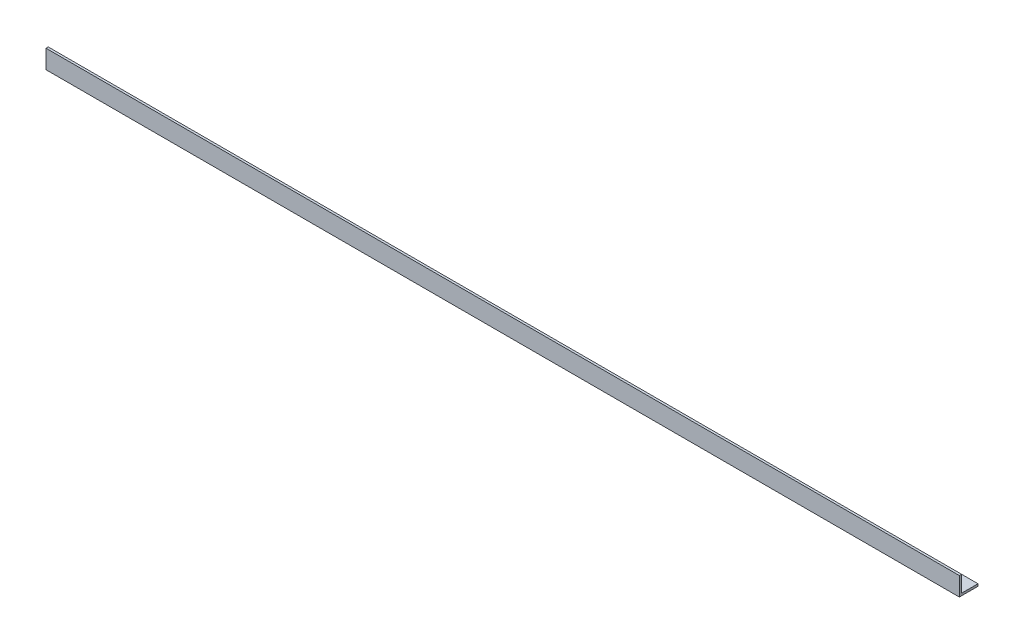
ISO-10303-21;
HEADER;
FILE_DESCRIPTION(('STEP AP214'),'2;1');
FILE_NAME('part.step','',(''),(''),'','','');
FILE_SCHEMA(('AUTOMOTIVE_DESIGN { 1 0 10303 214 1 1 1 1 }'));
ENDSEC;
DATA;
#1=APPLICATION_CONTEXT('core data for automotive mechanical design processes');
#2=APPLICATION_PROTOCOL_DEFINITION('international standard','automotive_design',2000,#1);
#3=PRODUCT_CONTEXT('',#1,'mechanical');
#4=PRODUCT('Part','Part','',(#3));
#5=PRODUCT_RELATED_PRODUCT_CATEGORY('part','',(#4));
#6=PRODUCT_DEFINITION_FORMATION('','',#4);
#7=PRODUCT_DEFINITION_CONTEXT('part definition',#1,'design');
#8=PRODUCT_DEFINITION('design','',#6,#7);
#9=PRODUCT_DEFINITION_SHAPE('','',#8);
#10=(LENGTH_UNIT() NAMED_UNIT(*) SI_UNIT(.MILLI.,.METRE.));
#11=(NAMED_UNIT(*) PLANE_ANGLE_UNIT() SI_UNIT($,.RADIAN.));
#12=(NAMED_UNIT(*) SI_UNIT($,.STERADIAN.) SOLID_ANGLE_UNIT());
#13=UNCERTAINTY_MEASURE_WITH_UNIT(LENGTH_MEASURE(1.E-05),#10,'distance_accuracy_value','');
#14=(GEOMETRIC_REPRESENTATION_CONTEXT(3) GLOBAL_UNCERTAINTY_ASSIGNED_CONTEXT((#13)) GLOBAL_UNIT_ASSIGNED_CONTEXT((#10,
#11,#12)) REPRESENTATION_CONTEXT('',''));
#15=CARTESIAN_POINT('',(0.,0.,0.));
#16=DIRECTION('',(0.,0.,1.));
#17=DIRECTION('',(1.,0.,0.));
#18=AXIS2_PLACEMENT_3D('',#15,#16,#17);
#19=CARTESIAN_POINT('',(2450.,0.,0.));
#20=DIRECTION('',(0.,1.,0.));
#21=DIRECTION('',(0.,0.,1.));
#22=AXIS2_PLACEMENT_3D('',#19,#20,#21);
#23=PLANE('',#22);
#24=DIRECTION('',(0.,0.,-1.));
#25=VECTOR('',#24,1.);
#26=CARTESIAN_POINT('',(0.,0.,0.));
#27=LINE('',#26,#25);
#28=CARTESIAN_POINT('',(0.,0.,0.));
#29=VERTEX_POINT('',#28);
#30=CARTESIAN_POINT('',(0.,0.,-50.));
#31=VERTEX_POINT('',#30);
#32=EDGE_CURVE('E119',#29,#31,#27,.T.);
#33=ORIENTED_EDGE('',*,*,#32,.T.);
#34=DIRECTION('',(-1.,0.,0.));
#35=VECTOR('',#34,1.);
#36=CARTESIAN_POINT('',(2450.,0.,-50.));
#37=LINE('',#36,#35);
#38=CARTESIAN_POINT('',(2450.,0.,-50.));
#39=VERTEX_POINT('',#38);
#40=EDGE_CURVE('E11',#39,#31,#37,.T.);
#41=ORIENTED_EDGE('',*,*,#40,.F.);
#42=DIRECTION('',(0.,0.,-1.));
#43=VECTOR('',#42,1.);
#44=CARTESIAN_POINT('',(2450.,0.,0.));
#45=LINE('',#44,#43);
#46=CARTESIAN_POINT('',(2450.,0.,0.));
#47=VERTEX_POINT('',#46);
#48=EDGE_CURVE('E83',#47,#39,#45,.T.);
#49=ORIENTED_EDGE('',*,*,#48,.F.);
#50=DIRECTION('',(-1.,0.,0.));
#51=VECTOR('',#50,1.);
#52=CARTESIAN_POINT('',(2450.,0.,0.));
#53=LINE('',#52,#51);
#54=EDGE_CURVE('E115',#47,#29,#53,.T.);
#55=ORIENTED_EDGE('',*,*,#54,.T.);
#56=EDGE_LOOP('',(#33,#41,#49,#55));
#57=FACE_BOUND('',#56,.T.);
#58=ADVANCED_FACE('F36',(#57),#23,.F.);
#59=CARTESIAN_POINT('',(2450.,6.,-50.));
#60=DIRECTION('',(0.,0.,-1.));
#61=DIRECTION('',(-1.,0.,0.));
#62=AXIS2_PLACEMENT_3D('',#59,#60,#61);
#63=PLANE('',#62);
#64=DIRECTION('',(0.,-1.,0.));
#65=VECTOR('',#64,1.);
#66=CARTESIAN_POINT('',(0.,6.,-50.));
#67=LINE('',#66,#65);
#68=CARTESIAN_POINT('',(0.,6.,-50.));
#69=VERTEX_POINT('',#68);
#70=EDGE_CURVE('E122',#69,#31,#67,.T.);
#71=ORIENTED_EDGE('',*,*,#70,.F.);
#72=DIRECTION('',(-1.,0.,0.));
#73=VECTOR('',#72,1.);
#74=CARTESIAN_POINT('',(2450.,6.,-50.));
#75=LINE('',#74,#73);
#76=CARTESIAN_POINT('',(2450.,6.,-50.));
#77=VERTEX_POINT('',#76);
#78=EDGE_CURVE('E45',#77,#69,#75,.T.);
#79=ORIENTED_EDGE('',*,*,#78,.F.);
#80=DIRECTION('',(0.,-1.,0.));
#81=VECTOR('',#80,1.);
#82=CARTESIAN_POINT('',(2450.,6.,-50.));
#83=LINE('',#82,#81);
#84=EDGE_CURVE('E212',#77,#39,#83,.T.);
#85=ORIENTED_EDGE('',*,*,#84,.T.);
#86=ORIENTED_EDGE('',*,*,#40,.T.);
#87=EDGE_LOOP('',(#71,#79,#85,#86));
#88=FACE_BOUND('',#87,.T.);
#89=ADVANCED_FACE('F144',(#88),#63,.T.);
#90=CARTESIAN_POINT('',(2450.,6.,0.));
#91=DIRECTION('',(0.,1.,0.));
#92=DIRECTION('',(0.,0.,1.));
#93=AXIS2_PLACEMENT_3D('',#90,#91,#92);
#94=PLANE('',#93);
#95=DIRECTION('',(0.,0.,-1.));
#96=VECTOR('',#95,1.);
#97=CARTESIAN_POINT('',(0.,6.,0.));
#98=LINE('',#97,#96);
#99=CARTESIAN_POINT('',(0.,6.,-6.));
#100=VERTEX_POINT('',#99);
#101=EDGE_CURVE('E125',#100,#69,#98,.T.);
#102=ORIENTED_EDGE('',*,*,#101,.F.);
#103=DIRECTION('',(-1.,0.,0.));
#104=VECTOR('',#103,1.);
#105=CARTESIAN_POINT('',(2450.,6.,-6.));
#106=LINE('',#105,#104);
#107=CARTESIAN_POINT('',(2450.,6.,-6.));
#108=VERTEX_POINT('',#107);
#109=EDGE_CURVE('E105',#108,#100,#106,.T.);
#110=ORIENTED_EDGE('',*,*,#109,.F.);
#111=DIRECTION('',(0.,0.,-1.));
#112=VECTOR('',#111,1.);
#113=CARTESIAN_POINT('',(2450.,6.,0.));
#114=LINE('',#113,#112);
#115=EDGE_CURVE('E111',#108,#77,#114,.T.);
#116=ORIENTED_EDGE('',*,*,#115,.T.);
#117=ORIENTED_EDGE('',*,*,#78,.T.);
#118=EDGE_LOOP('',(#102,#110,#116,#117));
#119=FACE_BOUND('',#118,.T.);
#120=ADVANCED_FACE('F141',(#119),#94,.T.);
#121=CARTESIAN_POINT('',(2450.,50.,-6.));
#122=DIRECTION('',(0.,0.,-1.));
#123=DIRECTION('',(-1.,0.,0.));
#124=AXIS2_PLACEMENT_3D('',#121,#122,#123);
#125=PLANE('',#124);
#126=DIRECTION('',(0.,1.,0.));
#127=VECTOR('',#126,1.);
#128=CARTESIAN_POINT('',(0.,50.,-6.));
#129=LINE('',#128,#127);
#130=CARTESIAN_POINT('',(0.,50.,-6.));
#131=VERTEX_POINT('',#130);
#132=EDGE_CURVE('E99',#131,#100,#129,.F.);
#133=ORIENTED_EDGE('',*,*,#132,.F.);
#134=DIRECTION('',(-1.,0.,0.));
#135=VECTOR('',#134,1.);
#136=CARTESIAN_POINT('',(2450.,50.,-6.));
#137=LINE('',#136,#135);
#138=CARTESIAN_POINT('',(2450.,50.,-6.));
#139=VERTEX_POINT('',#138);
#140=EDGE_CURVE('E94',#139,#131,#137,.T.);
#141=ORIENTED_EDGE('',*,*,#140,.F.);
#142=DIRECTION('',(0.,1.,0.));
#143=VECTOR('',#142,1.);
#144=CARTESIAN_POINT('',(2450.,50.,-6.));
#145=LINE('',#144,#143);
#146=EDGE_CURVE('E97',#139,#108,#145,.F.);
#147=ORIENTED_EDGE('',*,*,#146,.T.);
#148=ORIENTED_EDGE('',*,*,#109,.T.);
#149=EDGE_LOOP('',(#133,#141,#147,#148));
#150=FACE_BOUND('',#149,.T.);
#151=ADVANCED_FACE('F96',(#150),#125,.T.);
#152=CARTESIAN_POINT('',(2450.,50.,0.));
#153=DIRECTION('',(0.,1.,0.));
#154=DIRECTION('',(0.,0.,1.));
#155=AXIS2_PLACEMENT_3D('',#152,#153,#154);
#156=PLANE('',#155);
#157=DIRECTION('',(0.,0.,-1.));
#158=VECTOR('',#157,1.);
#159=CARTESIAN_POINT('',(0.,50.,0.));
#160=LINE('',#159,#158);
#161=CARTESIAN_POINT('',(0.,50.,0.));
#162=VERTEX_POINT('',#161);
#163=EDGE_CURVE('E129',#162,#131,#160,.T.);
#164=ORIENTED_EDGE('',*,*,#163,.F.);
#165=DIRECTION('',(-1.,0.,0.));
#166=VECTOR('',#165,1.);
#167=CARTESIAN_POINT('',(2450.,50.,0.));
#168=LINE('',#167,#166);
#169=CARTESIAN_POINT('',(2450.,50.,0.));
#170=VERTEX_POINT('',#169);
#171=EDGE_CURVE('E74',#170,#162,#168,.T.);
#172=ORIENTED_EDGE('',*,*,#171,.F.);
#173=DIRECTION('',(0.,0.,-1.));
#174=VECTOR('',#173,1.);
#175=CARTESIAN_POINT('',(2450.,50.,0.));
#176=LINE('',#175,#174);
#177=EDGE_CURVE('E109',#170,#139,#176,.T.);
#178=ORIENTED_EDGE('',*,*,#177,.T.);
#179=ORIENTED_EDGE('',*,*,#140,.T.);
#180=EDGE_LOOP('',(#164,#172,#178,#179));
#181=FACE_BOUND('',#180,.T.);
#182=ADVANCED_FACE('F113',(#181),#156,.T.);
#183=CARTESIAN_POINT('',(2450.,50.,0.));
#184=DIRECTION('',(0.,0.,-1.));
#185=DIRECTION('',(-1.,0.,0.));
#186=AXIS2_PLACEMENT_3D('',#183,#184,#185);
#187=PLANE('',#186);
#188=DIRECTION('',(0.,-1.,0.));
#189=VECTOR('',#188,1.);
#190=CARTESIAN_POINT('',(0.,50.,0.));
#191=LINE('',#190,#189);
#192=EDGE_CURVE('E77',#162,#29,#191,.T.);
#193=ORIENTED_EDGE('',*,*,#192,.T.);
#194=ORIENTED_EDGE('',*,*,#54,.F.);
#195=DIRECTION('',(0.,-1.,0.));
#196=VECTOR('',#195,1.);
#197=CARTESIAN_POINT('',(2450.,50.,0.));
#198=LINE('',#197,#196);
#199=EDGE_CURVE('E53',#170,#47,#198,.T.);
#200=ORIENTED_EDGE('',*,*,#199,.F.);
#201=ORIENTED_EDGE('',*,*,#171,.T.);
#202=EDGE_LOOP('',(#193,#194,#200,#201));
#203=FACE_BOUND('',#202,.T.);
#204=ADVANCED_FACE('F149',(#203),#187,.F.);
#205=CARTESIAN_POINT('',(2450.,0.,0.));
#206=DIRECTION('',(-1.,0.,0.));
#207=DIRECTION('',(0.,0.,1.));
#208=AXIS2_PLACEMENT_3D('',#205,#206,#207);
#209=PLANE('',#208);
#210=ORIENTED_EDGE('',*,*,#48,.T.);
#211=ORIENTED_EDGE('',*,*,#84,.F.);
#212=ORIENTED_EDGE('',*,*,#115,.F.);
#213=ORIENTED_EDGE('',*,*,#146,.F.);
#214=ORIENTED_EDGE('',*,*,#177,.F.);
#215=ORIENTED_EDGE('',*,*,#199,.T.);
#216=EDGE_LOOP('',(#210,#211,#212,#213,#214,#215));
#217=FACE_BOUND('',#216,.T.);
#218=ADVANCED_FACE('F108',(#217),#209,.F.);
#219=CARTESIAN_POINT('',(0.,0.,0.));
#220=DIRECTION('',(-1.,0.,0.));
#221=DIRECTION('',(0.,0.,1.));
#222=AXIS2_PLACEMENT_3D('',#219,#220,#221);
#223=PLANE('',#222);
#224=ORIENTED_EDGE('',*,*,#32,.F.);
#225=ORIENTED_EDGE('',*,*,#192,.F.);
#226=ORIENTED_EDGE('',*,*,#163,.T.);
#227=ORIENTED_EDGE('',*,*,#132,.T.);
#228=ORIENTED_EDGE('',*,*,#101,.T.);
#229=ORIENTED_EDGE('',*,*,#70,.T.);
#230=EDGE_LOOP('',(#224,#225,#226,#227,#228,#229));
#231=FACE_BOUND('',#230,.T.);
#232=ADVANCED_FACE('F147',(#231),#223,.T.);
#233=CLOSED_SHELL('',(#58,#89,#120,#151,#182,#204,#218,#232));
#234=MANIFOLD_SOLID_BREP('B2',#233);
#235=ADVANCED_BREP_SHAPE_REPRESENTATION('',(#18,#234),#14);
#236=SHAPE_DEFINITION_REPRESENTATION(#9,#235);
ENDSEC;
END-ISO-10303-21;
